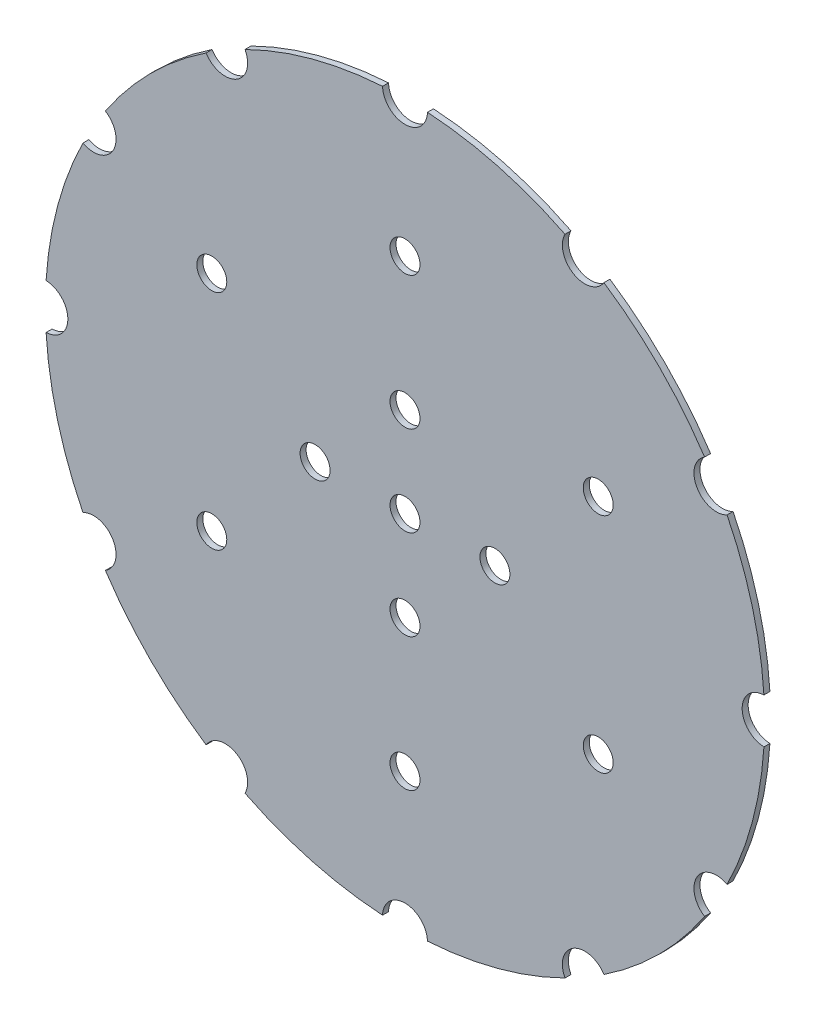
ISO-10303-21;
HEADER;
FILE_DESCRIPTION(('STEP AP214'),'2;1');
FILE_NAME('part.step','',(''),(''),'','','');
FILE_SCHEMA(('AUTOMOTIVE_DESIGN { 1 0 10303 214 1 1 1 1 }'));
ENDSEC;
DATA;
#1=APPLICATION_CONTEXT('core data for automotive mechanical design processes');
#2=APPLICATION_PROTOCOL_DEFINITION('international standard','automotive_design',2000,#1);
#3=PRODUCT_CONTEXT('',#1,'mechanical');
#4=PRODUCT('Part','Part','',(#3));
#5=PRODUCT_RELATED_PRODUCT_CATEGORY('part','',(#4));
#6=PRODUCT_DEFINITION_FORMATION('','',#4);
#7=PRODUCT_DEFINITION_CONTEXT('part definition',#1,'design');
#8=PRODUCT_DEFINITION('design','',#6,#7);
#9=PRODUCT_DEFINITION_SHAPE('','',#8);
#10=(LENGTH_UNIT() NAMED_UNIT(*) SI_UNIT(.MILLI.,.METRE.));
#11=(NAMED_UNIT(*) PLANE_ANGLE_UNIT() SI_UNIT($,.RADIAN.));
#12=(NAMED_UNIT(*) SI_UNIT($,.STERADIAN.) SOLID_ANGLE_UNIT());
#13=UNCERTAINTY_MEASURE_WITH_UNIT(LENGTH_MEASURE(1.E-05),#10,'distance_accuracy_value','');
#14=(GEOMETRIC_REPRESENTATION_CONTEXT(3) GLOBAL_UNCERTAINTY_ASSIGNED_CONTEXT((#13)) GLOBAL_UNIT_ASSIGNED_CONTEXT((#10,
#11,#12)) REPRESENTATION_CONTEXT('',''));
#15=CARTESIAN_POINT('',(0.,0.,0.));
#16=DIRECTION('',(0.,0.,1.));
#17=DIRECTION('',(1.,0.,0.));
#18=AXIS2_PLACEMENT_3D('',#15,#16,#17);
#19=CARTESIAN_POINT('',(0.,0.,2.54));
#20=DIRECTION('',(0.,0.,-1.));
#21=DIRECTION('',(-1.,0.,0.));
#22=AXIS2_PLACEMENT_3D('',#19,#20,#21);
#23=CYLINDRICAL_SURFACE('',#22,152.4);
#24=DIRECTION('',(0.,0.,-1.));
#25=VECTOR('',#24,1.);
#26=CARTESIAN_POINT('',(152.10234375,-9.52034798507049,1.27));
#27=LINE('',#26,#25);
#28=CARTESIAN_POINT('',(152.10234375,-9.52034798507049,2.54));
#29=VERTEX_POINT('',#28);
#30=CARTESIAN_POINT('',(152.10234375,-9.52034798507046,0.));
#31=VERTEX_POINT('',#30);
#32=EDGE_CURVE('E47',#29,#31,#27,.T.);
#33=ORIENTED_EDGE('',*,*,#32,.F.);
#34=CARTESIAN_POINT('',(0.,0.,2.54));
#35=DIRECTION('',(0.,0.,1.));
#36=DIRECTION('',(1.,0.,0.));
#37=AXIS2_PLACEMENT_3D('',#34,#35,#36);
#38=CIRCLE('',#37,152.4);
#39=CARTESIAN_POINT('',(136.484667655188,-67.8063086670611,2.54));
#40=VERTEX_POINT('',#39);
#41=EDGE_CURVE('E223',#40,#29,#38,.T.);
#42=ORIENTED_EDGE('',*,*,#41,.F.);
#43=DIRECTION('',(0.,0.,-1.));
#44=VECTOR('',#43,1.);
#45=CARTESIAN_POINT('',(136.484667655188,-67.8063086670611,1.27));
#46=LINE('',#45,#44);
#47=CARTESIAN_POINT('',(136.484667655188,-67.8063086670611,0.));
#48=VERTEX_POINT('',#47);
#49=EDGE_CURVE('E288',#48,#40,#46,.F.);
#50=ORIENTED_EDGE('',*,*,#49,.F.);
#51=CARTESIAN_POINT('',(0.,0.,0.));
#52=DIRECTION('',(0.,0.,1.));
#53=DIRECTION('',(1.,0.,0.));
#54=AXIS2_PLACEMENT_3D('',#51,#52,#53);
#55=CIRCLE('',#54,152.4);
#56=EDGE_CURVE('E233',#48,#31,#55,.T.);
#57=ORIENTED_EDGE('',*,*,#56,.T.);
#58=EDGE_LOOP('',(#33,#42,#50,#57));
#59=FACE_BOUND('',#58,.T.);
#60=ADVANCED_FACE('F33',(#59),#23,.T.);
#61=DIRECTION('',(0.,0.,-1.));
#62=VECTOR('',#61,1.);
#63=CARTESIAN_POINT('',(152.10234375,9.52034798507049,1.27));
#64=LINE('',#63,#62);
#65=CARTESIAN_POINT('',(152.10234375,9.52034798507049,0.));
#66=VERTEX_POINT('',#65);
#67=CARTESIAN_POINT('',(152.10234375,9.52034798507049,2.54));
#68=VERTEX_POINT('',#67);
#69=EDGE_CURVE('E286',#66,#68,#64,.F.);
#70=ORIENTED_EDGE('',*,*,#69,.F.);
#71=CARTESIAN_POINT('',(136.484667655189,67.8063086670593,0.));
#72=VERTEX_POINT('',#71);
#73=EDGE_CURVE('E229',#66,#72,#55,.T.);
#74=ORIENTED_EDGE('',*,*,#73,.T.);
#75=DIRECTION('',(0.,0.,-1.));
#76=VECTOR('',#75,1.);
#77=CARTESIAN_POINT('',(136.484667655189,67.8063086670592,1.27));
#78=LINE('',#77,#76);
#79=CARTESIAN_POINT('',(136.484667655189,67.8063086670592,2.54));
#80=VERTEX_POINT('',#79);
#81=EDGE_CURVE('E202',#80,#72,#78,.T.);
#82=ORIENTED_EDGE('',*,*,#81,.F.);
#83=EDGE_CURVE('E214',#68,#80,#38,.T.);
#84=ORIENTED_EDGE('',*,*,#83,.F.);
#85=EDGE_LOOP('',(#70,#74,#82,#84));
#86=FACE_BOUND('',#85,.T.);
#87=ADVANCED_FACE('F466',(#86),#23,.T.);
#88=DIRECTION('',(0.,0.,-1.));
#89=VECTOR('',#88,1.);
#90=CARTESIAN_POINT('',(126.964319670118,-84.2960350829392,1.27));
#91=LINE('',#90,#89);
#92=CARTESIAN_POINT('',(126.964319670118,-84.2960350829392,2.54));
#93=VERTEX_POINT('',#92);
#94=CARTESIAN_POINT('',(126.964319670118,-84.2960350829392,0.));
#95=VERTEX_POINT('',#94);
#96=EDGE_CURVE('E55',#93,#95,#91,.T.);
#97=ORIENTED_EDGE('',*,*,#96,.F.);
#98=CARTESIAN_POINT('',(84.2960350829387,-126.964319670118,2.54));
#99=VERTEX_POINT('',#98);
#100=EDGE_CURVE('E535',#99,#93,#38,.T.);
#101=ORIENTED_EDGE('',*,*,#100,.F.);
#102=DIRECTION('',(0.,0.,-1.));
#103=VECTOR('',#102,1.);
#104=CARTESIAN_POINT('',(84.2960350829387,-126.964319670118,1.27));
#105=LINE('',#104,#103);
#106=CARTESIAN_POINT('',(84.2960350829387,-126.964319670118,0.));
#107=VERTEX_POINT('',#106);
#108=EDGE_CURVE('E294',#107,#99,#105,.F.);
#109=ORIENTED_EDGE('',*,*,#108,.F.);
#110=EDGE_CURVE('E273',#107,#95,#55,.T.);
#111=ORIENTED_EDGE('',*,*,#110,.T.);
#112=EDGE_LOOP('',(#97,#101,#109,#111));
#113=FACE_BOUND('',#112,.T.);
#114=ADVANCED_FACE('F470',(#113),#23,.T.);
#115=DIRECTION('',(0.,0.,-1.));
#116=VECTOR('',#115,1.);
#117=CARTESIAN_POINT('',(67.8063086670607,-136.484667655189,1.27));
#118=LINE('',#117,#116);
#119=CARTESIAN_POINT('',(67.8063086670606,-136.484667655189,2.54));
#120=VERTEX_POINT('',#119);
#121=CARTESIAN_POINT('',(67.8063086670607,-136.484667655189,0.));
#122=VERTEX_POINT('',#121);
#123=EDGE_CURVE('E292',#120,#122,#118,.T.);
#124=ORIENTED_EDGE('',*,*,#123,.F.);
#125=CARTESIAN_POINT('',(9.52034798506995,-152.10234375,2.54));
#126=VERTEX_POINT('',#125);
#127=EDGE_CURVE('E531',#126,#120,#38,.T.);
#128=ORIENTED_EDGE('',*,*,#127,.F.);
#129=DIRECTION('',(0.,0.,-1.));
#130=VECTOR('',#129,1.);
#131=CARTESIAN_POINT('',(9.52034798506995,-152.10234375,1.27));
#132=LINE('',#131,#130);
#133=CARTESIAN_POINT('',(9.52034798506995,-152.10234375,0.));
#134=VERTEX_POINT('',#133);
#135=EDGE_CURVE('E298',#134,#126,#132,.F.);
#136=ORIENTED_EDGE('',*,*,#135,.F.);
#137=EDGE_CURVE('E268',#134,#122,#55,.T.);
#138=ORIENTED_EDGE('',*,*,#137,.T.);
#139=EDGE_LOOP('',(#124,#128,#136,#138));
#140=FACE_BOUND('',#139,.T.);
#141=ADVANCED_FACE('F640',(#140),#23,.T.);
#142=DIRECTION('',(0.,0.,-1.));
#143=VECTOR('',#142,1.);
#144=CARTESIAN_POINT('',(-9.52034798507101,-152.10234375,1.27));
#145=LINE('',#144,#143);
#146=CARTESIAN_POINT('',(-9.52034798507101,-152.10234375,2.54));
#147=VERTEX_POINT('',#146);
#148=CARTESIAN_POINT('',(-9.52034798507099,-152.10234375,0.));
#149=VERTEX_POINT('',#148);
#150=EDGE_CURVE('E296',#147,#149,#145,.T.);
#151=ORIENTED_EDGE('',*,*,#150,.F.);
#152=CARTESIAN_POINT('',(-67.8063086670615,-136.484667655188,2.54));
#153=VERTEX_POINT('',#152);
#154=EDGE_CURVE('E528',#153,#147,#38,.T.);
#155=ORIENTED_EDGE('',*,*,#154,.F.);
#156=DIRECTION('',(0.,0.,-1.));
#157=VECTOR('',#156,1.);
#158=CARTESIAN_POINT('',(-67.8063086670615,-136.484667655188,1.27));
#159=LINE('',#158,#157);
#160=CARTESIAN_POINT('',(-67.8063086670615,-136.484667655188,0.));
#161=VERTEX_POINT('',#160);
#162=EDGE_CURVE('E302',#161,#153,#159,.F.);
#163=ORIENTED_EDGE('',*,*,#162,.F.);
#164=EDGE_CURVE('E265',#161,#149,#55,.T.);
#165=ORIENTED_EDGE('',*,*,#164,.T.);
#166=EDGE_LOOP('',(#151,#155,#163,#165));
#167=FACE_BOUND('',#166,.T.);
#168=ADVANCED_FACE('F636',(#167),#23,.T.);
#169=DIRECTION('',(0.,0.,-1.));
#170=VECTOR('',#169,1.);
#171=CARTESIAN_POINT('',(-84.2960350829396,-126.964319670118,1.27));
#172=LINE('',#171,#170);
#173=CARTESIAN_POINT('',(-84.2960350829396,-126.964319670118,2.54));
#174=VERTEX_POINT('',#173);
#175=CARTESIAN_POINT('',(-84.2960350829396,-126.964319670118,0.));
#176=VERTEX_POINT('',#175);
#177=EDGE_CURVE('E300',#174,#176,#172,.T.);
#178=ORIENTED_EDGE('',*,*,#177,.F.);
#179=CARTESIAN_POINT('',(-126.964319670118,-84.2960350829383,2.54));
#180=VERTEX_POINT('',#179);
#181=EDGE_CURVE('E257',#180,#174,#38,.T.);
#182=ORIENTED_EDGE('',*,*,#181,.F.);
#183=DIRECTION('',(0.,0.,-1.));
#184=VECTOR('',#183,1.);
#185=CARTESIAN_POINT('',(-126.964319670118,-84.2960350829383,1.27));
#186=LINE('',#185,#184);
#187=CARTESIAN_POINT('',(-126.964319670118,-84.2960350829383,0.));
#188=VERTEX_POINT('',#187);
#189=EDGE_CURVE('E242',#188,#180,#186,.F.);
#190=ORIENTED_EDGE('',*,*,#189,.F.);
#191=EDGE_CURVE('E255',#188,#176,#55,.T.);
#192=ORIENTED_EDGE('',*,*,#191,.T.);
#193=EDGE_LOOP('',(#178,#182,#190,#192));
#194=FACE_BOUND('',#193,.T.);
#195=ADVANCED_FACE('F254',(#194),#23,.T.);
#196=DIRECTION('',(0.,0.,-1.));
#197=VECTOR('',#196,1.);
#198=CARTESIAN_POINT('',(-136.484667655189,-67.8063086670602,1.27));
#199=LINE('',#198,#197);
#200=CARTESIAN_POINT('',(-136.484667655189,-67.8063086670602,2.54));
#201=VERTEX_POINT('',#200);
#202=CARTESIAN_POINT('',(-136.484667655189,-67.8063086670602,0.));
#203=VERTEX_POINT('',#202);
#204=EDGE_CURVE('E245',#201,#203,#199,.T.);
#205=ORIENTED_EDGE('',*,*,#204,.F.);
#206=CARTESIAN_POINT('',(-152.10234375,-9.52034798506944,2.54));
#207=VERTEX_POINT('',#206);
#208=EDGE_CURVE('E525',#207,#201,#38,.T.);
#209=ORIENTED_EDGE('',*,*,#208,.F.);
#210=DIRECTION('',(0.,0.,-1.));
#211=VECTOR('',#210,1.);
#212=CARTESIAN_POINT('',(-152.10234375,-9.52034798506944,1.27));
#213=LINE('',#212,#211);
#214=CARTESIAN_POINT('',(-152.10234375,-9.52034798506944,0.));
#215=VERTEX_POINT('',#214);
#216=EDGE_CURVE('E306',#215,#207,#213,.F.);
#217=ORIENTED_EDGE('',*,*,#216,.F.);
#218=EDGE_CURVE('E264',#215,#203,#55,.T.);
#219=ORIENTED_EDGE('',*,*,#218,.T.);
#220=EDGE_LOOP('',(#205,#209,#217,#219));
#221=FACE_BOUND('',#220,.T.);
#222=ADVANCED_FACE('F523',(#221),#23,.T.);
#223=DIRECTION('',(0.,0.,-1.));
#224=VECTOR('',#223,1.);
#225=CARTESIAN_POINT('',(-152.10234375,9.52034798507156,1.27));
#226=LINE('',#225,#224);
#227=CARTESIAN_POINT('',(-152.10234375,9.52034798507156,2.54));
#228=VERTEX_POINT('',#227);
#229=CARTESIAN_POINT('',(-152.10234375,9.52034798507152,0.));
#230=VERTEX_POINT('',#229);
#231=EDGE_CURVE('E258',#228,#230,#226,.T.);
#232=ORIENTED_EDGE('',*,*,#231,.F.);
#233=CARTESIAN_POINT('',(-136.484667655188,67.8063086670621,2.54));
#234=VERTEX_POINT('',#233);
#235=EDGE_CURVE('E526',#234,#228,#38,.T.);
#236=ORIENTED_EDGE('',*,*,#235,.F.);
#237=DIRECTION('',(0.,0.,-1.));
#238=VECTOR('',#237,1.);
#239=CARTESIAN_POINT('',(-136.484667655188,67.8063086670621,1.27));
#240=LINE('',#239,#238);
#241=CARTESIAN_POINT('',(-136.484667655188,67.8063086670621,0.));
#242=VERTEX_POINT('',#241);
#243=EDGE_CURVE('E310',#242,#234,#240,.F.);
#244=ORIENTED_EDGE('',*,*,#243,.F.);
#245=EDGE_CURVE('E266',#242,#230,#55,.T.);
#246=ORIENTED_EDGE('',*,*,#245,.T.);
#247=EDGE_LOOP('',(#232,#236,#244,#246));
#248=FACE_BOUND('',#247,.T.);
#249=ADVANCED_FACE('F512',(#248),#23,.T.);
#250=DIRECTION('',(0.,0.,-1.));
#251=VECTOR('',#250,1.);
#252=CARTESIAN_POINT('',(-126.964319670117,84.2960350829401,1.27));
#253=LINE('',#252,#251);
#254=CARTESIAN_POINT('',(-126.964319670117,84.2960350829401,2.54));
#255=VERTEX_POINT('',#254);
#256=CARTESIAN_POINT('',(-126.964319670117,84.2960350829401,0.));
#257=VERTEX_POINT('',#256);
#258=EDGE_CURVE('E308',#255,#257,#253,.T.);
#259=ORIENTED_EDGE('',*,*,#258,.F.);
#260=CARTESIAN_POINT('',(-84.2960350829379,126.964319670119,2.54));
#261=VERTEX_POINT('',#260);
#262=EDGE_CURVE('E527',#261,#255,#38,.T.);
#263=ORIENTED_EDGE('',*,*,#262,.F.);
#264=DIRECTION('',(0.,0.,-1.));
#265=VECTOR('',#264,1.);
#266=CARTESIAN_POINT('',(-84.2960350829379,126.964319670119,1.27));
#267=LINE('',#266,#265);
#268=CARTESIAN_POINT('',(-84.2960350829379,126.964319670119,0.));
#269=VERTEX_POINT('',#268);
#270=EDGE_CURVE('E314',#269,#261,#267,.F.);
#271=ORIENTED_EDGE('',*,*,#270,.F.);
#272=EDGE_CURVE('E499',#269,#257,#55,.T.);
#273=ORIENTED_EDGE('',*,*,#272,.T.);
#274=EDGE_LOOP('',(#259,#263,#271,#273));
#275=FACE_BOUND('',#274,.T.);
#276=ADVANCED_FACE('F482',(#275),#23,.T.);
#277=DIRECTION('',(0.,0.,-1.));
#278=VECTOR('',#277,1.);
#279=CARTESIAN_POINT('',(-67.8063086670598,136.484667655189,1.27));
#280=LINE('',#279,#278);
#281=CARTESIAN_POINT('',(-67.8063086670598,136.484667655189,2.54));
#282=VERTEX_POINT('',#281);
#283=CARTESIAN_POINT('',(-67.8063086670598,136.484667655189,0.));
#284=VERTEX_POINT('',#283);
#285=EDGE_CURVE('E312',#282,#284,#280,.T.);
#286=ORIENTED_EDGE('',*,*,#285,.F.);
#287=CARTESIAN_POINT('',(-9.5203479850689,152.10234375,2.54));
#288=VERTEX_POINT('',#287);
#289=EDGE_CURVE('E225',#288,#282,#38,.T.);
#290=ORIENTED_EDGE('',*,*,#289,.F.);
#291=DIRECTION('',(0.,0.,-1.));
#292=VECTOR('',#291,1.);
#293=CARTESIAN_POINT('',(-9.5203479850689,152.10234375,1.27));
#294=LINE('',#293,#292);
#295=CARTESIAN_POINT('',(-9.5203479850689,152.10234375,0.));
#296=VERTEX_POINT('',#295);
#297=EDGE_CURVE('E318',#296,#288,#294,.F.);
#298=ORIENTED_EDGE('',*,*,#297,.F.);
#299=EDGE_CURVE('E497',#296,#284,#55,.T.);
#300=ORIENTED_EDGE('',*,*,#299,.T.);
#301=EDGE_LOOP('',(#286,#290,#298,#300));
#302=FACE_BOUND('',#301,.T.);
#303=ADVANCED_FACE('F477',(#302),#23,.T.);
#304=DIRECTION('',(0.,0.,-1.));
#305=VECTOR('',#304,1.);
#306=CARTESIAN_POINT('',(9.52034798507208,152.10234375,1.27));
#307=LINE('',#306,#305);
#308=CARTESIAN_POINT('',(9.52034798507208,152.10234375,2.54));
#309=VERTEX_POINT('',#308);
#310=CARTESIAN_POINT('',(9.52034798507206,152.10234375,0.));
#311=VERTEX_POINT('',#310);
#312=EDGE_CURVE('E316',#309,#311,#307,.T.);
#313=ORIENTED_EDGE('',*,*,#312,.F.);
#314=CARTESIAN_POINT('',(67.8063086670626,136.484667655188,2.54));
#315=VERTEX_POINT('',#314);
#316=EDGE_CURVE('E220',#315,#309,#38,.T.);
#317=ORIENTED_EDGE('',*,*,#316,.F.);
#318=DIRECTION('',(0.,0.,-1.));
#319=VECTOR('',#318,1.);
#320=CARTESIAN_POINT('',(67.8063086670626,136.484667655188,1.27));
#321=LINE('',#320,#319);
#322=CARTESIAN_POINT('',(67.8063086670626,136.484667655188,0.));
#323=VERTEX_POINT('',#322);
#324=EDGE_CURVE('E321',#323,#315,#321,.F.);
#325=ORIENTED_EDGE('',*,*,#324,.F.);
#326=EDGE_CURVE('E489',#323,#311,#55,.T.);
#327=ORIENTED_EDGE('',*,*,#326,.T.);
#328=EDGE_LOOP('',(#313,#317,#325,#327));
#329=FACE_BOUND('',#328,.T.);
#330=ADVANCED_FACE('F473',(#329),#23,.T.);
#331=DIRECTION('',(0.,0.,-1.));
#332=VECTOR('',#331,1.);
#333=CARTESIAN_POINT('',(84.2960350829405,126.964319670117,1.27));
#334=LINE('',#333,#332);
#335=CARTESIAN_POINT('',(84.2960350829405,126.964319670117,2.54));
#336=VERTEX_POINT('',#335);
#337=CARTESIAN_POINT('',(84.2960350829405,126.964319670117,0.));
#338=VERTEX_POINT('',#337);
#339=EDGE_CURVE('E219',#336,#338,#334,.T.);
#340=ORIENTED_EDGE('',*,*,#339,.F.);
#341=CARTESIAN_POINT('',(126.964319670119,84.2960350829374,2.54));
#342=VERTEX_POINT('',#341);
#343=EDGE_CURVE('E211',#342,#336,#38,.T.);
#344=ORIENTED_EDGE('',*,*,#343,.F.);
#345=DIRECTION('',(0.,0.,-1.));
#346=VECTOR('',#345,1.);
#347=CARTESIAN_POINT('',(126.964319670119,84.2960350829374,1.27));
#348=LINE('',#347,#346);
#349=CARTESIAN_POINT('',(126.964319670119,84.2960350829374,0.));
#350=VERTEX_POINT('',#349);
#351=EDGE_CURVE('E191',#350,#342,#348,.F.);
#352=ORIENTED_EDGE('',*,*,#351,.F.);
#353=EDGE_CURVE('E232',#350,#338,#55,.T.);
#354=ORIENTED_EDGE('',*,*,#353,.T.);
#355=EDGE_LOOP('',(#340,#344,#352,#354));
#356=FACE_BOUND('',#355,.T.);
#357=ADVANCED_FACE('F218',(#356),#23,.T.);
#358=CARTESIAN_POINT('',(0.,0.,2.54));
#359=DIRECTION('',(0.,0.,1.));
#360=DIRECTION('',(1.,0.,0.));
#361=AXIS2_PLACEMENT_3D('',#358,#359,#360);
#362=PLANE('',#361);
#363=CARTESIAN_POINT('',(0.,0.,2.54));
#364=DIRECTION('',(0.,0.,1.));
#365=DIRECTION('',(1.,0.,0.));
#366=AXIS2_PLACEMENT_3D('',#363,#364,#365);
#367=CIRCLE('',#366,6.35);
#368=CARTESIAN_POINT('',(6.35,0.,2.54));
#369=VERTEX_POINT('',#368);
#370=EDGE_CURVE('E394',#369,#369,#367,.T.);
#371=ORIENTED_EDGE('',*,*,#370,.F.);
#372=EDGE_LOOP('',(#371));
#373=FACE_BOUND('',#372,.T.);
#374=CARTESIAN_POINT('',(81.8792719070107,47.273019676562,2.54));
#375=DIRECTION('',(0.,0.,1.));
#376=DIRECTION('',(1.,0.,0.));
#377=AXIS2_PLACEMENT_3D('',#374,#375,#376);
#378=CIRCLE('',#377,6.35);
#379=CARTESIAN_POINT('',(88.2292719070107,47.273019676562,2.54));
#380=VERTEX_POINT('',#379);
#381=EDGE_CURVE('E393',#380,#380,#378,.T.);
#382=ORIENTED_EDGE('',*,*,#381,.F.);
#383=EDGE_LOOP('',(#382));
#384=FACE_BOUND('',#383,.T.);
#385=CARTESIAN_POINT('',(7.91033905045424E-13,94.5460393531258,2.54));
#386=DIRECTION('',(0.,0.,1.));
#387=DIRECTION('',(1.,0.,0.));
#388=AXIS2_PLACEMENT_3D('',#385,#386,#387);
#389=CIRCLE('',#388,6.35);
#390=CARTESIAN_POINT('',(6.35000000000079,94.5460393531258,2.54));
#391=VERTEX_POINT('',#390);
#392=EDGE_CURVE('E400',#391,#391,#389,.T.);
#393=ORIENTED_EDGE('',*,*,#392,.F.);
#394=EDGE_LOOP('',(#393));
#395=FACE_BOUND('',#394,.T.);
#396=CARTESIAN_POINT('',(-81.8792719070099,47.2730196765634,2.54));
#397=DIRECTION('',(0.,0.,1.));
#398=DIRECTION('',(1.,0.,0.));
#399=AXIS2_PLACEMENT_3D('',#396,#397,#398);
#400=CIRCLE('',#399,6.35);
#401=CARTESIAN_POINT('',(-75.5292719070099,47.2730196765634,2.54));
#402=VERTEX_POINT('',#401);
#403=EDGE_CURVE('E406',#402,#402,#400,.T.);
#404=ORIENTED_EDGE('',*,*,#403,.F.);
#405=EDGE_LOOP('',(#404));
#406=FACE_BOUND('',#405,.T.);
#407=CARTESIAN_POINT('',(-81.8792719070104,-47.2730196765626,2.54));
#408=DIRECTION('',(0.,0.,1.));
#409=DIRECTION('',(1.,0.,0.));
#410=AXIS2_PLACEMENT_3D('',#407,#408,#409);
#411=CIRCLE('',#410,6.35);
#412=CARTESIAN_POINT('',(-75.5292719070104,-47.2730196765626,2.54));
#413=VERTEX_POINT('',#412);
#414=EDGE_CURVE('E412',#413,#413,#411,.T.);
#415=ORIENTED_EDGE('',*,*,#414,.F.);
#416=EDGE_LOOP('',(#415));
#417=FACE_BOUND('',#416,.T.);
#418=CARTESIAN_POINT('',(-1.52655665885959E-13,-94.5460393531258,2.54));
#419=DIRECTION('',(0.,0.,1.));
#420=DIRECTION('',(1.,0.,0.));
#421=AXIS2_PLACEMENT_3D('',#418,#419,#420);
#422=CIRCLE('',#421,6.34999999999998);
#423=CARTESIAN_POINT('',(6.34999999999983,-94.5460393531258,2.54));
#424=VERTEX_POINT('',#423);
#425=EDGE_CURVE('E371',#424,#424,#422,.T.);
#426=ORIENTED_EDGE('',*,*,#425,.F.);
#427=EDGE_LOOP('',(#426));
#428=FACE_BOUND('',#427,.T.);
#429=CARTESIAN_POINT('',(38.1,0.,2.54));
#430=DIRECTION('',(0.,0.,1.));
#431=DIRECTION('',(1.,0.,0.));
#432=AXIS2_PLACEMENT_3D('',#429,#430,#431);
#433=CIRCLE('',#432,6.35);
#434=CARTESIAN_POINT('',(44.45,0.,2.54));
#435=VERTEX_POINT('',#434);
#436=EDGE_CURVE('E350',#435,#435,#433,.T.);
#437=ORIENTED_EDGE('',*,*,#436,.F.);
#438=EDGE_LOOP('',(#437));
#439=FACE_BOUND('',#438,.T.);
#440=CARTESIAN_POINT('',(81.8792719070102,-47.2730196765628,2.54));
#441=DIRECTION('',(0.,0.,1.));
#442=DIRECTION('',(1.,0.,0.));
#443=AXIS2_PLACEMENT_3D('',#440,#441,#442);
#444=CIRCLE('',#443,6.35);
#445=CARTESIAN_POINT('',(88.2292719070102,-47.2730196765628,2.54));
#446=VERTEX_POINT('',#445);
#447=EDGE_CURVE('E370',#446,#446,#444,.T.);
#448=ORIENTED_EDGE('',*,*,#447,.F.);
#449=EDGE_LOOP('',(#448));
#450=FACE_BOUND('',#449,.T.);
#451=CARTESIAN_POINT('',(4.13074029944024E-13,38.1,2.54));
#452=DIRECTION('',(0.,0.,1.));
#453=DIRECTION('',(1.,0.,0.));
#454=AXIS2_PLACEMENT_3D('',#451,#452,#453);
#455=CIRCLE('',#454,6.35);
#456=CARTESIAN_POINT('',(6.35000000000042,38.1,2.54));
#457=VERTEX_POINT('',#456);
#458=EDGE_CURVE('E358',#457,#457,#455,.T.);
#459=ORIENTED_EDGE('',*,*,#458,.F.);
#460=EDGE_LOOP('',(#459));
#461=FACE_BOUND('',#460,.T.);
#462=CARTESIAN_POINT('',(-38.1,2.80048590934101E-13,2.54));
#463=DIRECTION('',(0.,0.,1.));
#464=DIRECTION('',(1.,0.,0.));
#465=AXIS2_PLACEMENT_3D('',#462,#463,#464);
#466=CIRCLE('',#465,6.35);
#467=CARTESIAN_POINT('',(-31.75,2.80048590934101E-13,2.54));
#468=VERTEX_POINT('',#467);
#469=EDGE_CURVE('E357',#468,#468,#466,.T.);
#470=ORIENTED_EDGE('',*,*,#469,.F.);
#471=EDGE_LOOP('',(#470));
#472=FACE_BOUND('',#471,.T.);
#473=CARTESIAN_POINT('',(-1.47023151924178E-13,-38.1,2.54));
#474=DIRECTION('',(0.,0.,1.));
#475=DIRECTION('',(1.,0.,0.));
#476=AXIS2_PLACEMENT_3D('',#473,#474,#475);
#477=CIRCLE('',#476,6.35);
#478=CARTESIAN_POINT('',(6.34999999999986,-38.1,2.54));
#479=VERTEX_POINT('',#478);
#480=EDGE_CURVE('E364',#479,#479,#477,.T.);
#481=ORIENTED_EDGE('',*,*,#480,.F.);
#482=EDGE_LOOP('',(#481));
#483=FACE_BOUND('',#482,.T.);
#484=ORIENTED_EDGE('',*,*,#41,.T.);
#485=CARTESIAN_POINT('',(152.4,0.,2.54));
#486=DIRECTION('',(0.,0.,1.));
#487=DIRECTION('',(1.,0.,0.));
#488=AXIS2_PLACEMENT_3D('',#485,#486,#487);
#489=CIRCLE('',#488,9.525);
#490=EDGE_CURVE('E203',#68,#29,#489,.T.);
#491=ORIENTED_EDGE('',*,*,#490,.F.);
#492=ORIENTED_EDGE('',*,*,#83,.T.);
#493=CARTESIAN_POINT('',(131.982271536749,76.1999999999983,2.54));
#494=DIRECTION('',(0.,0.,1.));
#495=DIRECTION('',(1.,0.,0.));
#496=AXIS2_PLACEMENT_3D('',#493,#494,#495);
#497=CIRCLE('',#496,9.52499999999996);
#498=EDGE_CURVE('E194',#342,#80,#497,.T.);
#499=ORIENTED_EDGE('',*,*,#498,.F.);
#500=ORIENTED_EDGE('',*,*,#343,.T.);
#501=CARTESIAN_POINT('',(76.2000000000015,131.982271536748,2.54));
#502=DIRECTION('',(0.,0.,1.));
#503=DIRECTION('',(1.,0.,0.));
#504=AXIS2_PLACEMENT_3D('',#501,#502,#503);
#505=CIRCLE('',#504,9.52499999999998);
#506=EDGE_CURVE('E382',#315,#336,#505,.T.);
#507=ORIENTED_EDGE('',*,*,#506,.F.);
#508=ORIENTED_EDGE('',*,*,#316,.T.);
#509=CARTESIAN_POINT('',(1.59630516338477E-12,152.4,2.54));
#510=DIRECTION('',(0.,0.,1.));
#511=DIRECTION('',(1.,0.,0.));
#512=AXIS2_PLACEMENT_3D('',#509,#510,#511);
#513=CIRCLE('',#512,9.52499999999999);
#514=EDGE_CURVE('E387',#288,#309,#513,.T.);
#515=ORIENTED_EDGE('',*,*,#514,.F.);
#516=ORIENTED_EDGE('',*,*,#289,.T.);
#517=CARTESIAN_POINT('',(-76.1999999999988,131.982271536749,2.54));
#518=DIRECTION('',(0.,0.,1.));
#519=DIRECTION('',(1.,0.,0.));
#520=AXIS2_PLACEMENT_3D('',#517,#518,#519);
#521=CIRCLE('',#520,9.52499999999999);
#522=EDGE_CURVE('E327',#261,#282,#521,.T.);
#523=ORIENTED_EDGE('',*,*,#522,.F.);
#524=ORIENTED_EDGE('',*,*,#262,.T.);
#525=CARTESIAN_POINT('',(-131.982271536748,76.2000000000011,2.54));
#526=DIRECTION('',(0.,0.,1.));
#527=DIRECTION('',(1.,0.,0.));
#528=AXIS2_PLACEMENT_3D('',#525,#526,#527);
#529=CIRCLE('',#528,9.52500000000001);
#530=EDGE_CURVE('E324',#234,#255,#529,.T.);
#531=ORIENTED_EDGE('',*,*,#530,.F.);
#532=ORIENTED_EDGE('',*,*,#235,.T.);
#533=CARTESIAN_POINT('',(-152.4,1.06425285251177E-12,2.54));
#534=DIRECTION('',(0.,0.,1.));
#535=DIRECTION('',(1.,0.,0.));
#536=AXIS2_PLACEMENT_3D('',#533,#534,#535);
#537=CIRCLE('',#536,9.525);
#538=EDGE_CURVE('E326',#207,#228,#537,.T.);
#539=ORIENTED_EDGE('',*,*,#538,.F.);
#540=ORIENTED_EDGE('',*,*,#208,.T.);
#541=CARTESIAN_POINT('',(-131.982271536749,-76.1999999999993,2.54));
#542=DIRECTION('',(0.,0.,1.));
#543=DIRECTION('',(1.,0.,0.));
#544=AXIS2_PLACEMENT_3D('',#541,#542,#543);
#545=CIRCLE('',#544,9.52499999999998);
#546=EDGE_CURVE('E329',#180,#201,#545,.T.);
#547=ORIENTED_EDGE('',*,*,#546,.F.);
#548=ORIENTED_EDGE('',*,*,#181,.T.);
#549=CARTESIAN_POINT('',(-76.2000000000006,-131.982271536748,2.54));
#550=DIRECTION('',(0.,0.,1.));
#551=DIRECTION('',(1.,0.,0.));
#552=AXIS2_PLACEMENT_3D('',#549,#550,#551);
#553=CIRCLE('',#552,9.52500000000003);
#554=EDGE_CURVE('E331',#153,#174,#553,.T.);
#555=ORIENTED_EDGE('',*,*,#554,.F.);
#556=ORIENTED_EDGE('',*,*,#154,.T.);
#557=CARTESIAN_POINT('',(-5.32101862300415E-13,-152.4,2.54));
#558=DIRECTION('',(0.,0.,1.));
#559=DIRECTION('',(1.,0.,0.));
#560=AXIS2_PLACEMENT_3D('',#557,#558,#559);
#561=CIRCLE('',#560,9.52499999999998);
#562=EDGE_CURVE('E336',#126,#147,#561,.T.);
#563=ORIENTED_EDGE('',*,*,#562,.F.);
#564=ORIENTED_EDGE('',*,*,#127,.T.);
#565=CARTESIAN_POINT('',(76.1999999999997,-131.982271536749,2.54));
#566=DIRECTION('',(0.,0.,1.));
#567=DIRECTION('',(1.,0.,0.));
#568=AXIS2_PLACEMENT_3D('',#565,#566,#567);
#569=CIRCLE('',#568,9.52499999999999);
#570=EDGE_CURVE('E341',#99,#120,#569,.T.);
#571=ORIENTED_EDGE('',*,*,#570,.F.);
#572=ORIENTED_EDGE('',*,*,#100,.T.);
#573=CARTESIAN_POINT('',(131.982271536748,-76.2000000000002,2.54));
#574=DIRECTION('',(0.,0.,1.));
#575=DIRECTION('',(1.,0.,0.));
#576=AXIS2_PLACEMENT_3D('',#573,#574,#575);
#577=CIRCLE('',#576,9.52499999999996);
#578=EDGE_CURVE('E345',#40,#93,#577,.T.);
#579=ORIENTED_EDGE('',*,*,#578,.F.);
#580=EDGE_LOOP('',(#484,#491,#492,#499,#500,#507,#508,#515,#516,#523,#524,#531,#532,#539,#540,
#547,#548,#555,#556,#563,#564,#571,#572,#579));
#581=FACE_BOUND('',#580,.T.);
#582=ADVANCED_FACE('F209',(#373,#384,#395,#406,#417,#428,#439,#450,#461,#472,#483,#581),#362,.T.);
#583=CARTESIAN_POINT('',(0.,0.,0.));
#584=DIRECTION('',(0.,0.,1.));
#585=DIRECTION('',(1.,0.,0.));
#586=AXIS2_PLACEMENT_3D('',#583,#584,#585);
#587=PLANE('',#586);
#588=CARTESIAN_POINT('',(0.,0.,0.));
#589=DIRECTION('',(0.,0.,1.));
#590=DIRECTION('',(1.,0.,0.));
#591=AXIS2_PLACEMENT_3D('',#588,#589,#590);
#592=CIRCLE('',#591,6.35);
#593=CARTESIAN_POINT('',(6.35,0.,0.));
#594=VERTEX_POINT('',#593);
#595=EDGE_CURVE('E422',#594,#594,#592,.T.);
#596=ORIENTED_EDGE('',*,*,#595,.T.);
#597=EDGE_LOOP('',(#596));
#598=FACE_BOUND('',#597,.T.);
#599=CARTESIAN_POINT('',(152.4,0.,0.));
#600=DIRECTION('',(0.,0.,1.));
#601=DIRECTION('',(1.,0.,0.));
#602=AXIS2_PLACEMENT_3D('',#599,#600,#601);
#603=CIRCLE('',#602,9.525);
#604=EDGE_CURVE('E353',#66,#31,#603,.T.);
#605=ORIENTED_EDGE('',*,*,#604,.T.);
#606=ORIENTED_EDGE('',*,*,#56,.F.);
#607=CARTESIAN_POINT('',(131.982271536748,-76.2000000000002,0.));
#608=DIRECTION('',(0.,0.,1.));
#609=DIRECTION('',(1.,0.,0.));
#610=AXIS2_PLACEMENT_3D('',#607,#608,#609);
#611=CIRCLE('',#610,9.52499999999996);
#612=EDGE_CURVE('E343',#48,#95,#611,.T.);
#613=ORIENTED_EDGE('',*,*,#612,.T.);
#614=ORIENTED_EDGE('',*,*,#110,.F.);
#615=CARTESIAN_POINT('',(76.1999999999997,-131.982271536749,0.));
#616=DIRECTION('',(0.,0.,1.));
#617=DIRECTION('',(1.,0.,0.));
#618=AXIS2_PLACEMENT_3D('',#615,#616,#617);
#619=CIRCLE('',#618,9.52499999999999);
#620=EDGE_CURVE('E338',#107,#122,#619,.T.);
#621=ORIENTED_EDGE('',*,*,#620,.T.);
#622=ORIENTED_EDGE('',*,*,#137,.F.);
#623=CARTESIAN_POINT('',(-5.32101862300415E-13,-152.4,0.));
#624=DIRECTION('',(0.,0.,1.));
#625=DIRECTION('',(1.,0.,0.));
#626=AXIS2_PLACEMENT_3D('',#623,#624,#625);
#627=CIRCLE('',#626,9.52499999999998);
#628=EDGE_CURVE('E333',#134,#149,#627,.T.);
#629=ORIENTED_EDGE('',*,*,#628,.T.);
#630=ORIENTED_EDGE('',*,*,#164,.F.);
#631=CARTESIAN_POINT('',(-76.2000000000006,-131.982271536748,0.));
#632=DIRECTION('',(0.,0.,1.));
#633=DIRECTION('',(1.,0.,0.));
#634=AXIS2_PLACEMENT_3D('',#631,#632,#633);
#635=CIRCLE('',#634,9.52500000000003);
#636=EDGE_CURVE('E11',#176,#161,#635,.F.);
#637=ORIENTED_EDGE('',*,*,#636,.F.);
#638=ORIENTED_EDGE('',*,*,#191,.F.);
#639=CARTESIAN_POINT('',(-131.982271536749,-76.1999999999993,0.));
#640=DIRECTION('',(0.,0.,1.));
#641=DIRECTION('',(1.,0.,0.));
#642=AXIS2_PLACEMENT_3D('',#639,#640,#641);
#643=CIRCLE('',#642,9.52499999999998);
#644=EDGE_CURVE('E40',#203,#188,#643,.F.);
#645=ORIENTED_EDGE('',*,*,#644,.F.);
#646=ORIENTED_EDGE('',*,*,#218,.F.);
#647=CARTESIAN_POINT('',(-152.4,1.06425285251177E-12,0.));
#648=DIRECTION('',(0.,0.,1.));
#649=DIRECTION('',(1.,0.,0.));
#650=AXIS2_PLACEMENT_3D('',#647,#648,#649);
#651=CIRCLE('',#650,9.525);
#652=EDGE_CURVE('E237',#230,#215,#651,.F.);
#653=ORIENTED_EDGE('',*,*,#652,.F.);
#654=ORIENTED_EDGE('',*,*,#245,.F.);
#655=CARTESIAN_POINT('',(-131.982271536748,76.2000000000011,0.));
#656=DIRECTION('',(0.,0.,1.));
#657=DIRECTION('',(1.,0.,0.));
#658=AXIS2_PLACEMENT_3D('',#655,#656,#657);
#659=CIRCLE('',#658,9.52500000000001);
#660=EDGE_CURVE('E235',#257,#242,#659,.F.);
#661=ORIENTED_EDGE('',*,*,#660,.F.);
#662=ORIENTED_EDGE('',*,*,#272,.F.);
#663=CARTESIAN_POINT('',(-76.1999999999988,131.982271536749,0.));
#664=DIRECTION('',(0.,0.,1.));
#665=DIRECTION('',(1.,0.,0.));
#666=AXIS2_PLACEMENT_3D('',#663,#664,#665);
#667=CIRCLE('',#666,9.52499999999999);
#668=EDGE_CURVE('E222',#284,#269,#667,.F.);
#669=ORIENTED_EDGE('',*,*,#668,.F.);
#670=ORIENTED_EDGE('',*,*,#299,.F.);
#671=CARTESIAN_POINT('',(1.59630516338477E-12,152.4,0.));
#672=DIRECTION('',(0.,0.,1.));
#673=DIRECTION('',(1.,0.,0.));
#674=AXIS2_PLACEMENT_3D('',#671,#672,#673);
#675=CIRCLE('',#674,9.52499999999999);
#676=EDGE_CURVE('E384',#296,#311,#675,.T.);
#677=ORIENTED_EDGE('',*,*,#676,.T.);
#678=ORIENTED_EDGE('',*,*,#326,.F.);
#679=CARTESIAN_POINT('',(76.2000000000015,131.982271536748,0.));
#680=DIRECTION('',(0.,0.,1.));
#681=DIRECTION('',(1.,0.,0.));
#682=AXIS2_PLACEMENT_3D('',#679,#680,#681);
#683=CIRCLE('',#682,9.52499999999998);
#684=EDGE_CURVE('E215',#323,#338,#683,.T.);
#685=ORIENTED_EDGE('',*,*,#684,.T.);
#686=ORIENTED_EDGE('',*,*,#353,.F.);
#687=CARTESIAN_POINT('',(131.982271536749,76.1999999999983,0.));
#688=DIRECTION('',(0.,0.,1.));
#689=DIRECTION('',(1.,0.,0.));
#690=AXIS2_PLACEMENT_3D('',#687,#688,#689);
#691=CIRCLE('',#690,9.52499999999996);
#692=EDGE_CURVE('E197',#350,#72,#691,.T.);
#693=ORIENTED_EDGE('',*,*,#692,.T.);
#694=ORIENTED_EDGE('',*,*,#73,.F.);
#695=EDGE_LOOP('',(#605,#606,#613,#614,#621,#622,#629,#630,#637,#638,#645,#646,#653,#654,#661,
#662,#669,#670,#677,#678,#685,#686,#693,#694));
#696=FACE_BOUND('',#695,.T.);
#697=CARTESIAN_POINT('',(81.8792719070107,47.273019676562,0.));
#698=DIRECTION('',(0.,0.,1.));
#699=DIRECTION('',(1.,0.,0.));
#700=AXIS2_PLACEMENT_3D('',#697,#698,#699);
#701=CIRCLE('',#700,6.35);
#702=CARTESIAN_POINT('',(88.2292719070107,47.273019676562,0.));
#703=VERTEX_POINT('',#702);
#704=EDGE_CURVE('E390',#703,#703,#701,.T.);
#705=ORIENTED_EDGE('',*,*,#704,.T.);
#706=EDGE_LOOP('',(#705));
#707=FACE_BOUND('',#706,.T.);
#708=CARTESIAN_POINT('',(7.91033905045424E-13,94.5460393531258,0.));
#709=DIRECTION('',(0.,0.,1.));
#710=DIRECTION('',(1.,0.,0.));
#711=AXIS2_PLACEMENT_3D('',#708,#709,#710);
#712=CIRCLE('',#711,6.35);
#713=CARTESIAN_POINT('',(6.35000000000079,94.5460393531258,0.));
#714=VERTEX_POINT('',#713);
#715=EDGE_CURVE('E397',#714,#714,#712,.T.);
#716=ORIENTED_EDGE('',*,*,#715,.T.);
#717=EDGE_LOOP('',(#716));
#718=FACE_BOUND('',#717,.T.);
#719=CARTESIAN_POINT('',(-81.8792719070099,47.2730196765634,0.));
#720=DIRECTION('',(0.,0.,1.));
#721=DIRECTION('',(1.,0.,0.));
#722=AXIS2_PLACEMENT_3D('',#719,#720,#721);
#723=CIRCLE('',#722,6.35);
#724=CARTESIAN_POINT('',(-75.5292719070099,47.2730196765634,0.));
#725=VERTEX_POINT('',#724);
#726=EDGE_CURVE('E403',#725,#725,#723,.T.);
#727=ORIENTED_EDGE('',*,*,#726,.T.);
#728=EDGE_LOOP('',(#727));
#729=FACE_BOUND('',#728,.T.);
#730=CARTESIAN_POINT('',(-81.8792719070104,-47.2730196765626,0.));
#731=DIRECTION('',(0.,0.,1.));
#732=DIRECTION('',(1.,0.,0.));
#733=AXIS2_PLACEMENT_3D('',#730,#731,#732);
#734=CIRCLE('',#733,6.35);
#735=CARTESIAN_POINT('',(-75.5292719070104,-47.2730196765626,0.));
#736=VERTEX_POINT('',#735);
#737=EDGE_CURVE('E409',#736,#736,#734,.T.);
#738=ORIENTED_EDGE('',*,*,#737,.T.);
#739=EDGE_LOOP('',(#738));
#740=FACE_BOUND('',#739,.T.);
#741=CARTESIAN_POINT('',(-1.52655665885959E-13,-94.5460393531258,0.));
#742=DIRECTION('',(0.,0.,1.));
#743=DIRECTION('',(1.,0.,0.));
#744=AXIS2_PLACEMENT_3D('',#741,#742,#743);
#745=CIRCLE('',#744,6.34999999999998);
#746=CARTESIAN_POINT('',(6.34999999999983,-94.5460393531258,0.));
#747=VERTEX_POINT('',#746);
#748=EDGE_CURVE('E415',#747,#747,#745,.T.);
#749=ORIENTED_EDGE('',*,*,#748,.T.);
#750=EDGE_LOOP('',(#749));
#751=FACE_BOUND('',#750,.T.);
#752=CARTESIAN_POINT('',(38.1,0.,0.));
#753=DIRECTION('',(0.,0.,1.));
#754=DIRECTION('',(1.,0.,0.));
#755=AXIS2_PLACEMENT_3D('',#752,#753,#754);
#756=CIRCLE('',#755,6.35);
#757=CARTESIAN_POINT('',(44.45,0.,0.));
#758=VERTEX_POINT('',#757);
#759=EDGE_CURVE('E347',#758,#758,#756,.T.);
#760=ORIENTED_EDGE('',*,*,#759,.T.);
#761=EDGE_LOOP('',(#760));
#762=FACE_BOUND('',#761,.T.);
#763=CARTESIAN_POINT('',(81.8792719070102,-47.2730196765628,0.));
#764=DIRECTION('',(0.,0.,1.));
#765=DIRECTION('',(1.,0.,0.));
#766=AXIS2_PLACEMENT_3D('',#763,#764,#765);
#767=CIRCLE('',#766,6.35);
#768=CARTESIAN_POINT('',(88.2292719070102,-47.2730196765628,0.));
#769=VERTEX_POINT('',#768);
#770=EDGE_CURVE('E367',#769,#769,#767,.T.);
#771=ORIENTED_EDGE('',*,*,#770,.T.);
#772=EDGE_LOOP('',(#771));
#773=FACE_BOUND('',#772,.T.);
#774=CARTESIAN_POINT('',(4.13074029944024E-13,38.1,0.));
#775=DIRECTION('',(0.,0.,1.));
#776=DIRECTION('',(1.,0.,0.));
#777=AXIS2_PLACEMENT_3D('',#774,#775,#776);
#778=CIRCLE('',#777,6.35);
#779=CARTESIAN_POINT('',(6.35000000000042,38.1,0.));
#780=VERTEX_POINT('',#779);
#781=EDGE_CURVE('E374',#780,#780,#778,.T.);
#782=ORIENTED_EDGE('',*,*,#781,.T.);
#783=EDGE_LOOP('',(#782));
#784=FACE_BOUND('',#783,.T.);
#785=CARTESIAN_POINT('',(-38.1,2.80048590934101E-13,0.));
#786=DIRECTION('',(0.,0.,1.));
#787=DIRECTION('',(1.,0.,0.));
#788=AXIS2_PLACEMENT_3D('',#785,#786,#787);
#789=CIRCLE('',#788,6.35);
#790=CARTESIAN_POINT('',(-31.75,2.80048590934101E-13,0.));
#791=VERTEX_POINT('',#790);
#792=EDGE_CURVE('E354',#791,#791,#789,.T.);
#793=ORIENTED_EDGE('',*,*,#792,.T.);
#794=EDGE_LOOP('',(#793));
#795=FACE_BOUND('',#794,.T.);
#796=CARTESIAN_POINT('',(-1.47023151924178E-13,-38.1,0.));
#797=DIRECTION('',(0.,0.,1.));
#798=DIRECTION('',(1.,0.,0.));
#799=AXIS2_PLACEMENT_3D('',#796,#797,#798);
#800=CIRCLE('',#799,6.35);
#801=CARTESIAN_POINT('',(6.34999999999986,-38.1,0.));
#802=VERTEX_POINT('',#801);
#803=EDGE_CURVE('E361',#802,#802,#800,.T.);
#804=ORIENTED_EDGE('',*,*,#803,.T.);
#805=EDGE_LOOP('',(#804));
#806=FACE_BOUND('',#805,.T.);
#807=ADVANCED_FACE('F261',(#598,#696,#707,#718,#729,#740,#751,#762,#773,#784,#795,#806),#587,.F.);
#808=CARTESIAN_POINT('',(-1.47023151924178E-13,-38.1,2.54));
#809=DIRECTION('',(0.,0.,-1.));
#810=DIRECTION('',(-1.,0.,0.));
#811=AXIS2_PLACEMENT_3D('',#808,#809,#810);
#812=CYLINDRICAL_SURFACE('',#811,6.35);
#813=ORIENTED_EDGE('',*,*,#480,.T.);
#814=EDGE_LOOP('',(#813));
#815=FACE_BOUND('',#814,.T.);
#816=ORIENTED_EDGE('',*,*,#803,.F.);
#817=EDGE_LOOP('',(#816));
#818=FACE_BOUND('',#817,.T.);
#819=ADVANCED_FACE('F454',(#815,#818),#812,.F.);
#820=CARTESIAN_POINT('',(-38.1,2.80048590934101E-13,2.54));
#821=DIRECTION('',(0.,0.,-1.));
#822=DIRECTION('',(-1.,0.,0.));
#823=AXIS2_PLACEMENT_3D('',#820,#821,#822);
#824=CYLINDRICAL_SURFACE('',#823,6.35);
#825=ORIENTED_EDGE('',*,*,#469,.T.);
#826=EDGE_LOOP('',(#825));
#827=FACE_BOUND('',#826,.T.);
#828=ORIENTED_EDGE('',*,*,#792,.F.);
#829=EDGE_LOOP('',(#828));
#830=FACE_BOUND('',#829,.T.);
#831=ADVANCED_FACE('F457',(#827,#830),#824,.F.);
#832=CARTESIAN_POINT('',(4.13074029944024E-13,38.1,2.54));
#833=DIRECTION('',(0.,0.,-1.));
#834=DIRECTION('',(-1.,0.,0.));
#835=AXIS2_PLACEMENT_3D('',#832,#833,#834);
#836=CYLINDRICAL_SURFACE('',#835,6.35);
#837=ORIENTED_EDGE('',*,*,#458,.T.);
#838=EDGE_LOOP('',(#837));
#839=FACE_BOUND('',#838,.T.);
#840=ORIENTED_EDGE('',*,*,#781,.F.);
#841=EDGE_LOOP('',(#840));
#842=FACE_BOUND('',#841,.T.);
#843=ADVANCED_FACE('F585',(#839,#842),#836,.F.);
#844=CARTESIAN_POINT('',(81.8792719070102,-47.2730196765628,2.54));
#845=DIRECTION('',(0.,0.,-1.));
#846=DIRECTION('',(-1.,0.,0.));
#847=AXIS2_PLACEMENT_3D('',#844,#845,#846);
#848=CYLINDRICAL_SURFACE('',#847,6.35);
#849=ORIENTED_EDGE('',*,*,#447,.T.);
#850=EDGE_LOOP('',(#849));
#851=FACE_BOUND('',#850,.T.);
#852=ORIENTED_EDGE('',*,*,#770,.F.);
#853=EDGE_LOOP('',(#852));
#854=FACE_BOUND('',#853,.T.);
#855=ADVANCED_FACE('F584',(#851,#854),#848,.F.);
#856=CARTESIAN_POINT('',(131.982271536749,76.1999999999983,2.54));
#857=DIRECTION('',(0.,0.,-1.));
#858=DIRECTION('',(-1.,0.,0.));
#859=AXIS2_PLACEMENT_3D('',#856,#857,#858);
#860=CYLINDRICAL_SURFACE('',#859,9.52499999999996);
#861=ORIENTED_EDGE('',*,*,#81,.T.);
#862=ORIENTED_EDGE('',*,*,#692,.F.);
#863=ORIENTED_EDGE('',*,*,#351,.T.);
#864=ORIENTED_EDGE('',*,*,#498,.T.);
#865=EDGE_LOOP('',(#861,#862,#863,#864));
#866=FACE_BOUND('',#865,.T.);
#867=ADVANCED_FACE('F193',(#866),#860,.F.);
#868=CARTESIAN_POINT('',(76.2000000000015,131.982271536748,2.54));
#869=DIRECTION('',(0.,0.,-1.));
#870=DIRECTION('',(-1.,0.,0.));
#871=AXIS2_PLACEMENT_3D('',#868,#869,#870);
#872=CYLINDRICAL_SURFACE('',#871,9.52499999999998);
#873=ORIENTED_EDGE('',*,*,#339,.T.);
#874=ORIENTED_EDGE('',*,*,#684,.F.);
#875=ORIENTED_EDGE('',*,*,#324,.T.);
#876=ORIENTED_EDGE('',*,*,#506,.T.);
#877=EDGE_LOOP('',(#873,#874,#875,#876));
#878=FACE_BOUND('',#877,.T.);
#879=ADVANCED_FACE('F495',(#878),#872,.F.);
#880=CARTESIAN_POINT('',(1.59630516338477E-12,152.4,2.54));
#881=DIRECTION('',(0.,0.,-1.));
#882=DIRECTION('',(-1.,0.,0.));
#883=AXIS2_PLACEMENT_3D('',#880,#881,#882);
#884=CYLINDRICAL_SURFACE('',#883,9.52499999999999);
#885=ORIENTED_EDGE('',*,*,#312,.T.);
#886=ORIENTED_EDGE('',*,*,#676,.F.);
#887=ORIENTED_EDGE('',*,*,#297,.T.);
#888=ORIENTED_EDGE('',*,*,#514,.T.);
#889=EDGE_LOOP('',(#885,#886,#887,#888));
#890=FACE_BOUND('',#889,.T.);
#891=ADVANCED_FACE('F576',(#890),#884,.F.);
#892=CARTESIAN_POINT('',(-76.1999999999988,131.982271536749,2.54));
#893=DIRECTION('',(0.,0.,-1.));
#894=DIRECTION('',(-1.,0.,0.));
#895=AXIS2_PLACEMENT_3D('',#892,#893,#894);
#896=CYLINDRICAL_SURFACE('',#895,9.52499999999999);
#897=ORIENTED_EDGE('',*,*,#285,.T.);
#898=ORIENTED_EDGE('',*,*,#668,.T.);
#899=ORIENTED_EDGE('',*,*,#270,.T.);
#900=ORIENTED_EDGE('',*,*,#522,.T.);
#901=EDGE_LOOP('',(#897,#898,#899,#900));
#902=FACE_BOUND('',#901,.T.);
#903=ADVANCED_FACE('F572',(#902),#896,.F.);
#904=CARTESIAN_POINT('',(-131.982271536748,76.2000000000011,2.54));
#905=DIRECTION('',(0.,0.,-1.));
#906=DIRECTION('',(-1.,0.,0.));
#907=AXIS2_PLACEMENT_3D('',#904,#905,#906);
#908=CYLINDRICAL_SURFACE('',#907,9.52500000000001);
#909=ORIENTED_EDGE('',*,*,#258,.T.);
#910=ORIENTED_EDGE('',*,*,#660,.T.);
#911=ORIENTED_EDGE('',*,*,#243,.T.);
#912=ORIENTED_EDGE('',*,*,#530,.T.);
#913=EDGE_LOOP('',(#909,#910,#911,#912));
#914=FACE_BOUND('',#913,.T.);
#915=ADVANCED_FACE('F575',(#914),#908,.F.);
#916=CARTESIAN_POINT('',(-152.4,1.06425285251177E-12,2.54));
#917=DIRECTION('',(0.,0.,-1.));
#918=DIRECTION('',(-1.,0.,0.));
#919=AXIS2_PLACEMENT_3D('',#916,#917,#918);
#920=CYLINDRICAL_SURFACE('',#919,9.525);
#921=ORIENTED_EDGE('',*,*,#231,.T.);
#922=ORIENTED_EDGE('',*,*,#652,.T.);
#923=ORIENTED_EDGE('',*,*,#216,.T.);
#924=ORIENTED_EDGE('',*,*,#538,.T.);
#925=EDGE_LOOP('',(#921,#922,#923,#924));
#926=FACE_BOUND('',#925,.T.);
#927=ADVANCED_FACE('F519',(#926),#920,.F.);
#928=CARTESIAN_POINT('',(-131.982271536749,-76.1999999999993,2.54));
#929=DIRECTION('',(0.,0.,-1.));
#930=DIRECTION('',(-1.,0.,0.));
#931=AXIS2_PLACEMENT_3D('',#928,#929,#930);
#932=CYLINDRICAL_SURFACE('',#931,9.52499999999998);
#933=ORIENTED_EDGE('',*,*,#204,.T.);
#934=ORIENTED_EDGE('',*,*,#644,.T.);
#935=ORIENTED_EDGE('',*,*,#189,.T.);
#936=ORIENTED_EDGE('',*,*,#546,.T.);
#937=EDGE_LOOP('',(#933,#934,#935,#936));
#938=FACE_BOUND('',#937,.T.);
#939=ADVANCED_FACE('F241',(#938),#932,.F.);
#940=CARTESIAN_POINT('',(-76.2000000000006,-131.982271536748,2.54));
#941=DIRECTION('',(0.,0.,-1.));
#942=DIRECTION('',(-1.,0.,0.));
#943=AXIS2_PLACEMENT_3D('',#940,#941,#942);
#944=CYLINDRICAL_SURFACE('',#943,9.52500000000003);
#945=ORIENTED_EDGE('',*,*,#177,.T.);
#946=ORIENTED_EDGE('',*,*,#636,.T.);
#947=ORIENTED_EDGE('',*,*,#162,.T.);
#948=ORIENTED_EDGE('',*,*,#554,.T.);
#949=EDGE_LOOP('',(#945,#946,#947,#948));
#950=FACE_BOUND('',#949,.T.);
#951=ADVANCED_FACE('F608',(#950),#944,.F.);
#952=CARTESIAN_POINT('',(-5.32101862300415E-13,-152.4,2.54));
#953=DIRECTION('',(0.,0.,-1.));
#954=DIRECTION('',(-1.,0.,0.));
#955=AXIS2_PLACEMENT_3D('',#952,#953,#954);
#956=CYLINDRICAL_SURFACE('',#955,9.52499999999998);
#957=ORIENTED_EDGE('',*,*,#150,.T.);
#958=ORIENTED_EDGE('',*,*,#628,.F.);
#959=ORIENTED_EDGE('',*,*,#135,.T.);
#960=ORIENTED_EDGE('',*,*,#562,.T.);
#961=EDGE_LOOP('',(#957,#958,#959,#960));
#962=FACE_BOUND('',#961,.T.);
#963=ADVANCED_FACE('F604',(#962),#956,.F.);
#964=CARTESIAN_POINT('',(76.1999999999997,-131.982271536749,2.54));
#965=DIRECTION('',(0.,0.,-1.));
#966=DIRECTION('',(-1.,0.,0.));
#967=AXIS2_PLACEMENT_3D('',#964,#965,#966);
#968=CYLINDRICAL_SURFACE('',#967,9.52499999999999);
#969=ORIENTED_EDGE('',*,*,#123,.T.);
#970=ORIENTED_EDGE('',*,*,#620,.F.);
#971=ORIENTED_EDGE('',*,*,#108,.T.);
#972=ORIENTED_EDGE('',*,*,#570,.T.);
#973=EDGE_LOOP('',(#969,#970,#971,#972));
#974=FACE_BOUND('',#973,.T.);
#975=ADVANCED_FACE('F601',(#974),#968,.F.);
#976=CARTESIAN_POINT('',(131.982271536748,-76.2000000000002,2.54));
#977=DIRECTION('',(0.,0.,-1.));
#978=DIRECTION('',(-1.,0.,0.));
#979=AXIS2_PLACEMENT_3D('',#976,#977,#978);
#980=CYLINDRICAL_SURFACE('',#979,9.52499999999996);
#981=ORIENTED_EDGE('',*,*,#96,.T.);
#982=ORIENTED_EDGE('',*,*,#612,.F.);
#983=ORIENTED_EDGE('',*,*,#49,.T.);
#984=ORIENTED_EDGE('',*,*,#578,.T.);
#985=EDGE_LOOP('',(#981,#982,#983,#984));
#986=FACE_BOUND('',#985,.T.);
#987=ADVANCED_FACE('F597',(#986),#980,.F.);
#988=CARTESIAN_POINT('',(38.1,0.,2.54));
#989=DIRECTION('',(0.,0.,-1.));
#990=DIRECTION('',(-1.,0.,0.));
#991=AXIS2_PLACEMENT_3D('',#988,#989,#990);
#992=CYLINDRICAL_SURFACE('',#991,6.35);
#993=ORIENTED_EDGE('',*,*,#436,.T.);
#994=EDGE_LOOP('',(#993));
#995=FACE_BOUND('',#994,.T.);
#996=ORIENTED_EDGE('',*,*,#759,.F.);
#997=EDGE_LOOP('',(#996));
#998=FACE_BOUND('',#997,.T.);
#999=ADVANCED_FACE('F560',(#995,#998),#992,.F.);
#1000=CARTESIAN_POINT('',(-1.52655665885959E-13,-94.5460393531258,2.54));
#1001=DIRECTION('',(0.,0.,-1.));
#1002=DIRECTION('',(-1.,0.,0.));
#1003=AXIS2_PLACEMENT_3D('',#1000,#1001,#1002);
#1004=CYLINDRICAL_SURFACE('',#1003,6.34999999999998);
#1005=ORIENTED_EDGE('',*,*,#425,.T.);
#1006=EDGE_LOOP('',(#1005));
#1007=FACE_BOUND('',#1006,.T.);
#1008=ORIENTED_EDGE('',*,*,#748,.F.);
#1009=EDGE_LOOP('',(#1008));
#1010=FACE_BOUND('',#1009,.T.);
#1011=ADVANCED_FACE('F556',(#1007,#1010),#1004,.F.);
#1012=CARTESIAN_POINT('',(-81.8792719070104,-47.2730196765626,2.54));
#1013=DIRECTION('',(0.,0.,-1.));
#1014=DIRECTION('',(-1.,0.,0.));
#1015=AXIS2_PLACEMENT_3D('',#1012,#1013,#1014);
#1016=CYLINDRICAL_SURFACE('',#1015,6.35);
#1017=ORIENTED_EDGE('',*,*,#414,.T.);
#1018=EDGE_LOOP('',(#1017));
#1019=FACE_BOUND('',#1018,.T.);
#1020=ORIENTED_EDGE('',*,*,#737,.F.);
#1021=EDGE_LOOP('',(#1020));
#1022=FACE_BOUND('',#1021,.T.);
#1023=ADVANCED_FACE('F559',(#1019,#1022),#1016,.F.);
#1024=CARTESIAN_POINT('',(-81.8792719070099,47.2730196765634,2.54));
#1025=DIRECTION('',(0.,0.,-1.));
#1026=DIRECTION('',(-1.,0.,0.));
#1027=AXIS2_PLACEMENT_3D('',#1024,#1025,#1026);
#1028=CYLINDRICAL_SURFACE('',#1027,6.35);
#1029=ORIENTED_EDGE('',*,*,#403,.T.);
#1030=EDGE_LOOP('',(#1029));
#1031=FACE_BOUND('',#1030,.T.);
#1032=ORIENTED_EDGE('',*,*,#726,.F.);
#1033=EDGE_LOOP('',(#1032));
#1034=FACE_BOUND('',#1033,.T.);
#1035=ADVANCED_FACE('F564',(#1031,#1034),#1028,.F.);
#1036=CARTESIAN_POINT('',(7.91033905045424E-13,94.5460393531258,2.54));
#1037=DIRECTION('',(0.,0.,-1.));
#1038=DIRECTION('',(-1.,0.,0.));
#1039=AXIS2_PLACEMENT_3D('',#1036,#1037,#1038);
#1040=CYLINDRICAL_SURFACE('',#1039,6.35);
#1041=ORIENTED_EDGE('',*,*,#392,.T.);
#1042=EDGE_LOOP('',(#1041));
#1043=FACE_BOUND('',#1042,.T.);
#1044=ORIENTED_EDGE('',*,*,#715,.F.);
#1045=EDGE_LOOP('',(#1044));
#1046=FACE_BOUND('',#1045,.T.);
#1047=ADVANCED_FACE('F552',(#1043,#1046),#1040,.F.);
#1048=CARTESIAN_POINT('',(81.8792719070107,47.273019676562,2.54));
#1049=DIRECTION('',(0.,0.,-1.));
#1050=DIRECTION('',(-1.,0.,0.));
#1051=AXIS2_PLACEMENT_3D('',#1048,#1049,#1050);
#1052=CYLINDRICAL_SURFACE('',#1051,6.35);
#1053=ORIENTED_EDGE('',*,*,#381,.T.);
#1054=EDGE_LOOP('',(#1053));
#1055=FACE_BOUND('',#1054,.T.);
#1056=ORIENTED_EDGE('',*,*,#704,.F.);
#1057=EDGE_LOOP('',(#1056));
#1058=FACE_BOUND('',#1057,.T.);
#1059=ADVANCED_FACE('F545',(#1055,#1058),#1052,.F.);
#1060=CARTESIAN_POINT('',(152.4,0.,2.54));
#1061=DIRECTION('',(0.,0.,-1.));
#1062=DIRECTION('',(-1.,0.,0.));
#1063=AXIS2_PLACEMENT_3D('',#1060,#1061,#1062);
#1064=CYLINDRICAL_SURFACE('',#1063,9.525);
#1065=ORIENTED_EDGE('',*,*,#32,.T.);
#1066=ORIENTED_EDGE('',*,*,#604,.F.);
#1067=ORIENTED_EDGE('',*,*,#69,.T.);
#1068=ORIENTED_EDGE('',*,*,#490,.T.);
#1069=EDGE_LOOP('',(#1065,#1066,#1067,#1068));
#1070=FACE_BOUND('',#1069,.T.);
#1071=ADVANCED_FACE('F543',(#1070),#1064,.F.);
#1072=CARTESIAN_POINT('',(0.,0.,2.54));
#1073=DIRECTION('',(0.,0.,-1.));
#1074=DIRECTION('',(-1.,0.,0.));
#1075=AXIS2_PLACEMENT_3D('',#1072,#1073,#1074);
#1076=CYLINDRICAL_SURFACE('',#1075,6.35);
#1077=ORIENTED_EDGE('',*,*,#370,.T.);
#1078=EDGE_LOOP('',(#1077));
#1079=FACE_BOUND('',#1078,.T.);
#1080=ORIENTED_EDGE('',*,*,#595,.F.);
#1081=EDGE_LOOP('',(#1080));
#1082=FACE_BOUND('',#1081,.T.);
#1083=ADVANCED_FACE('F428',(#1079,#1082),#1076,.F.);
#1084=CLOSED_SHELL('',(#60,#87,#114,#141,#168,#195,#222,#249,#276,#303,#330,#357,#582,#807,#819,
#831,#843,#855,#867,#879,#891,#903,#915,#927,#939,#951,#963,#975,#987,#999,#1011,#1023,#1035,
#1047,#1059,#1071,#1083));
#1085=MANIFOLD_SOLID_BREP('B2',#1084);
#1086=ADVANCED_BREP_SHAPE_REPRESENTATION('',(#18,#1085),#14);
#1087=SHAPE_DEFINITION_REPRESENTATION(#9,#1086);
ENDSEC;
END-ISO-10303-21;
